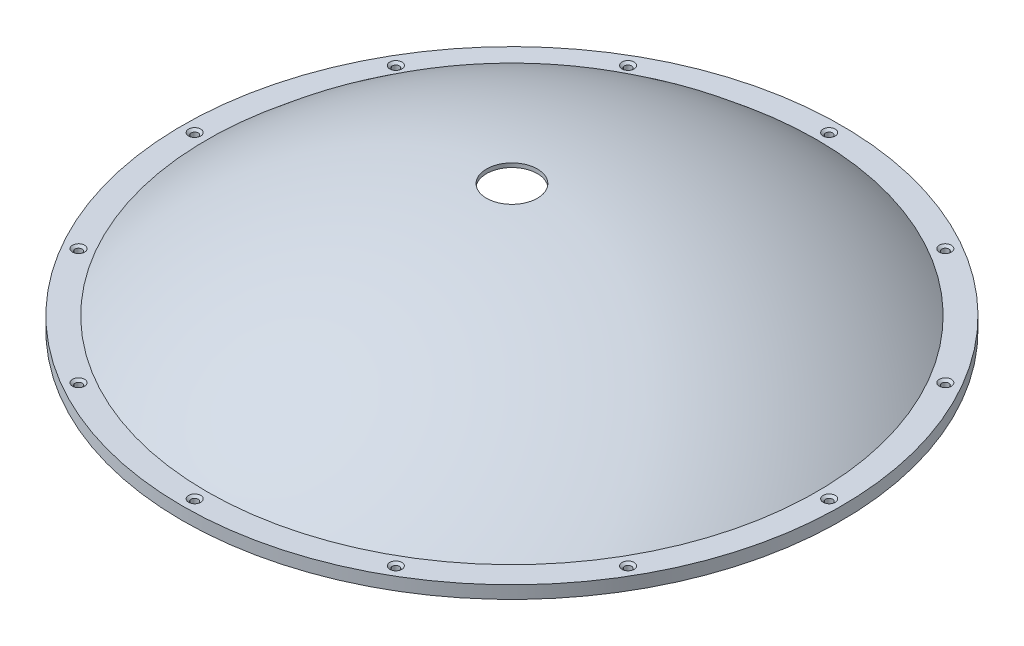
ISO-10303-21;
HEADER;
FILE_DESCRIPTION(('STEP AP214'),'2;1');
FILE_NAME('part.step','',(''),(''),'','','');
FILE_SCHEMA(('AUTOMOTIVE_DESIGN { 1 0 10303 214 1 1 1 1 }'));
ENDSEC;
DATA;
#1=APPLICATION_CONTEXT('core data for automotive mechanical design processes');
#2=APPLICATION_PROTOCOL_DEFINITION('international standard','automotive_design',2000,#1);
#3=PRODUCT_CONTEXT('',#1,'mechanical');
#4=PRODUCT('Part','Part','',(#3));
#5=PRODUCT_RELATED_PRODUCT_CATEGORY('part','',(#4));
#6=PRODUCT_DEFINITION_FORMATION('','',#4);
#7=PRODUCT_DEFINITION_CONTEXT('part definition',#1,'design');
#8=PRODUCT_DEFINITION('design','',#6,#7);
#9=PRODUCT_DEFINITION_SHAPE('','',#8);
#10=(LENGTH_UNIT() NAMED_UNIT(*) SI_UNIT(.MILLI.,.METRE.));
#11=(NAMED_UNIT(*) PLANE_ANGLE_UNIT() SI_UNIT($,.RADIAN.));
#12=(NAMED_UNIT(*) SI_UNIT($,.STERADIAN.) SOLID_ANGLE_UNIT());
#13=UNCERTAINTY_MEASURE_WITH_UNIT(LENGTH_MEASURE(1.E-05),#10,'distance_accuracy_value','');
#14=(GEOMETRIC_REPRESENTATION_CONTEXT(3) GLOBAL_UNCERTAINTY_ASSIGNED_CONTEXT((#13)) GLOBAL_UNIT_ASSIGNED_CONTEXT((#10,
#11,#12)) REPRESENTATION_CONTEXT('',''));
#15=CARTESIAN_POINT('',(0.,0.,0.));
#16=DIRECTION('',(0.,0.,1.));
#17=DIRECTION('',(1.,0.,0.));
#18=AXIS2_PLACEMENT_3D('',#15,#16,#17);
#19=CARTESIAN_POINT('',(0.,55.,0.));
#20=DIRECTION('',(0.,1.,0.));
#21=DIRECTION('',(0.,0.,1.));
#22=AXIS2_PLACEMENT_3D('',#19,#20,#21);
#23=CYLINDRICAL_SURFACE('',#22,82.3595);
#24=CARTESIAN_POINT('',(0.,0.,0.));
#25=DIRECTION('',(0.,1.,0.));
#26=DIRECTION('',(0.,0.,1.));
#27=AXIS2_PLACEMENT_3D('',#24,#25,#26);
#28=CIRCLE('',#27,82.3595);
#29=CARTESIAN_POINT('',(0.,0.,82.3595));
#30=VERTEX_POINT('',#29);
#31=EDGE_CURVE('E56',#30,#30,#28,.T.);
#32=ORIENTED_EDGE('',*,*,#31,.T.);
#33=EDGE_LOOP('',(#32));
#34=FACE_BOUND('',#33,.T.);
#35=CARTESIAN_POINT('',(0.,3.175,0.));
#36=DIRECTION('',(0.,1.,0.));
#37=DIRECTION('',(0.,0.,1.));
#38=AXIS2_PLACEMENT_3D('',#35,#36,#37);
#39=CIRCLE('',#38,82.3595);
#40=CARTESIAN_POINT('',(0.,3.175,82.3595));
#41=VERTEX_POINT('',#40);
#42=EDGE_CURVE('E10',#41,#41,#39,.T.);
#43=ORIENTED_EDGE('',*,*,#42,.F.);
#44=EDGE_LOOP('',(#43));
#45=FACE_BOUND('',#44,.T.);
#46=ADVANCED_FACE('F31',(#34,#45),#23,.T.);
#47=CARTESIAN_POINT('',(-82.3595,3.175,0.));
#48=DIRECTION('',(0.,1.,0.));
#49=DIRECTION('',(0.,0.,1.));
#50=AXIS2_PLACEMENT_3D('',#47,#48,#49);
#51=PLANE('',#50);
#52=CARTESIAN_POINT('',(-68.6582775056797,3.175,39.6398749999993));
#53=DIRECTION('',(0.,1.,0.));
#54=DIRECTION('',(0.,0.,1.));
#55=AXIS2_PLACEMENT_3D('',#52,#53,#54);
#56=CIRCLE('',#55,1.51129999999999);
#57=CARTESIAN_POINT('',(-68.6582775056797,3.175,41.1511749999993));
#58=VERTEX_POINT('',#57);
#59=EDGE_CURVE('E164',#58,#58,#56,.T.);
#60=ORIENTED_EDGE('',*,*,#59,.F.);
#61=EDGE_LOOP('',(#60));
#62=FACE_BOUND('',#61,.T.);
#63=CARTESIAN_POINT('',(-39.6398750000007,3.175,68.658277505679));
#64=DIRECTION('',(0.,1.,0.));
#65=DIRECTION('',(0.,0.,1.));
#66=AXIS2_PLACEMENT_3D('',#63,#64,#65);
#67=CIRCLE('',#66,1.5113);
#68=CARTESIAN_POINT('',(-39.6398750000007,3.175,70.169577505679));
#69=VERTEX_POINT('',#68);
#70=EDGE_CURVE('E155',#69,#69,#67,.T.);
#71=ORIENTED_EDGE('',*,*,#70,.F.);
#72=EDGE_LOOP('',(#71));
#73=FACE_BOUND('',#72,.T.);
#74=CARTESIAN_POINT('',(-6.89582176881005E-13,3.175,79.27975));
#75=DIRECTION('',(0.,1.,0.));
#76=DIRECTION('',(0.,0.,1.));
#77=AXIS2_PLACEMENT_3D('',#74,#75,#76);
#78=CIRCLE('',#77,1.5113);
#79=CARTESIAN_POINT('',(-6.89582176881005E-13,3.175,80.79105));
#80=VERTEX_POINT('',#79);
#81=EDGE_CURVE('E146',#80,#80,#78,.T.);
#82=ORIENTED_EDGE('',*,*,#81,.F.);
#83=EDGE_LOOP('',(#82));
#84=FACE_BOUND('',#83,.T.);
#85=CARTESIAN_POINT('',(39.6398749999995,3.175,68.6582775056796));
#86=DIRECTION('',(0.,1.,0.));
#87=DIRECTION('',(0.,0.,1.));
#88=AXIS2_PLACEMENT_3D('',#85,#86,#87);
#89=CIRCLE('',#88,1.5113);
#90=CARTESIAN_POINT('',(39.6398749999995,3.175,70.1695775056797));
#91=VERTEX_POINT('',#90);
#92=EDGE_CURVE('E137',#91,#91,#89,.T.);
#93=ORIENTED_EDGE('',*,*,#92,.F.);
#94=EDGE_LOOP('',(#93));
#95=FACE_BOUND('',#94,.T.);
#96=CARTESIAN_POINT('',(68.6582775056791,3.175,39.6398750000004));
#97=DIRECTION('',(0.,1.,0.));
#98=DIRECTION('',(0.,0.,1.));
#99=AXIS2_PLACEMENT_3D('',#96,#97,#98);
#100=CIRCLE('',#99,1.51130000000001);
#101=CARTESIAN_POINT('',(68.6582775056791,3.175,41.1511750000004));
#102=VERTEX_POINT('',#101);
#103=EDGE_CURVE('E128',#102,#102,#100,.T.);
#104=ORIENTED_EDGE('',*,*,#103,.F.);
#105=EDGE_LOOP('',(#104));
#106=FACE_BOUND('',#105,.T.);
#107=CARTESIAN_POINT('',(79.27975,3.175,4.47985690742466E-13));
#108=DIRECTION('',(0.,1.,0.));
#109=DIRECTION('',(0.,0.,1.));
#110=AXIS2_PLACEMENT_3D('',#107,#108,#109);
#111=CIRCLE('',#110,1.51129999999999);
#112=CARTESIAN_POINT('',(79.27975,3.175,1.51130000000044));
#113=VERTEX_POINT('',#112);
#114=EDGE_CURVE('E119',#113,#113,#111,.T.);
#115=ORIENTED_EDGE('',*,*,#114,.F.);
#116=EDGE_LOOP('',(#115));
#117=FACE_BOUND('',#116,.T.);
#118=CARTESIAN_POINT('',(68.6582775056795,3.175,-39.6398749999996));
#119=DIRECTION('',(0.,1.,0.));
#120=DIRECTION('',(0.,0.,1.));
#121=AXIS2_PLACEMENT_3D('',#118,#119,#120);
#122=CIRCLE('',#121,1.51130000000001);
#123=CARTESIAN_POINT('',(68.6582775056795,3.175,-38.1285749999996));
#124=VERTEX_POINT('',#123);
#125=EDGE_CURVE('E110',#124,#124,#122,.T.);
#126=ORIENTED_EDGE('',*,*,#125,.F.);
#127=EDGE_LOOP('',(#126));
#128=FACE_BOUND('',#127,.T.);
#129=CARTESIAN_POINT('',(39.6398750000002,3.175,-68.6582775056792));
#130=DIRECTION('',(0.,1.,0.));
#131=DIRECTION('',(0.,0.,1.));
#132=AXIS2_PLACEMENT_3D('',#129,#130,#131);
#133=CIRCLE('',#132,1.5113);
#134=CARTESIAN_POINT('',(39.6398750000002,3.175,-67.1469775056792));
#135=VERTEX_POINT('',#134);
#136=EDGE_CURVE('E101',#135,#135,#133,.T.);
#137=ORIENTED_EDGE('',*,*,#136,.F.);
#138=EDGE_LOOP('',(#137));
#139=FACE_BOUND('',#138,.T.);
#140=CARTESIAN_POINT('',(2.23992845371233E-13,3.175,-79.27975));
#141=DIRECTION('',(0.,1.,0.));
#142=DIRECTION('',(0.,0.,1.));
#143=AXIS2_PLACEMENT_3D('',#140,#141,#142);
#144=CIRCLE('',#143,1.5113);
#145=CARTESIAN_POINT('',(2.23992845371233E-13,3.175,-77.76845));
#146=VERTEX_POINT('',#145);
#147=EDGE_CURVE('E92',#146,#146,#144,.T.);
#148=ORIENTED_EDGE('',*,*,#147,.F.);
#149=EDGE_LOOP('',(#148));
#150=FACE_BOUND('',#149,.T.);
#151=CARTESIAN_POINT('',(-39.6398749999999,3.175,-68.6582775056794));
#152=DIRECTION('',(0.,1.,0.));
#153=DIRECTION('',(0.,0.,1.));
#154=AXIS2_PLACEMENT_3D('',#151,#152,#153);
#155=CIRCLE('',#154,1.5113);
#156=CARTESIAN_POINT('',(-39.6398749999999,3.175,-67.1469775056794));
#157=VERTEX_POINT('',#156);
#158=EDGE_CURVE('E83',#157,#157,#155,.T.);
#159=ORIENTED_EDGE('',*,*,#158,.F.);
#160=EDGE_LOOP('',(#159));
#161=FACE_BOUND('',#160,.T.);
#162=CARTESIAN_POINT('',(-68.6582775056793,3.175,-39.6398750000001));
#163=DIRECTION('',(0.,1.,0.));
#164=DIRECTION('',(0.,0.,1.));
#165=AXIS2_PLACEMENT_3D('',#162,#163,#164);
#166=CIRCLE('',#165,1.51130000000001);
#167=CARTESIAN_POINT('',(-68.6582775056793,3.175,-38.1285750000001));
#168=VERTEX_POINT('',#167);
#169=EDGE_CURVE('E74',#168,#168,#166,.T.);
#170=ORIENTED_EDGE('',*,*,#169,.F.);
#171=EDGE_LOOP('',(#170));
#172=FACE_BOUND('',#171,.T.);
#173=CARTESIAN_POINT('',(-79.27975,3.175,0.));
#174=DIRECTION('',(0.,1.,0.));
#175=DIRECTION('',(0.,0.,1.));
#176=AXIS2_PLACEMENT_3D('',#173,#174,#175);
#177=CIRCLE('',#176,1.51129999999999);
#178=CARTESIAN_POINT('',(-79.27975,3.175,1.51129999999999));
#179=VERTEX_POINT('',#178);
#180=EDGE_CURVE('E65',#179,#179,#177,.T.);
#181=ORIENTED_EDGE('',*,*,#180,.F.);
#182=EDGE_LOOP('',(#181));
#183=FACE_BOUND('',#182,.T.);
#184=ORIENTED_EDGE('',*,*,#42,.T.);
#185=EDGE_LOOP('',(#184));
#186=FACE_BOUND('',#185,.T.);
#187=CARTESIAN_POINT('',(0.,3.175,0.));
#188=DIRECTION('',(0.,1.,0.));
#189=DIRECTION('',(0.,0.,1.));
#190=AXIS2_PLACEMENT_3D('',#187,#188,#189);
#191=CIRCLE('',#190,76.2);
#192=CARTESIAN_POINT('',(0.,3.175,76.2));
#193=VERTEX_POINT('',#192);
#194=EDGE_CURVE('E37',#193,#193,#191,.T.);
#195=ORIENTED_EDGE('',*,*,#194,.F.);
#196=EDGE_LOOP('',(#195));
#197=FACE_BOUND('',#196,.T.);
#198=ADVANCED_FACE('F170',(#62,#73,#84,#95,#106,#117,#128,#139,#150,#161,#172,#183,#186,#197),
#51,.T.);
#199=CARTESIAN_POINT('',(0.,-83.3775265720187,0.));
#200=DIRECTION('',(0.,1.,0.));
#201=DIRECTION('',(-1.,0.,0.));
#202=AXIS2_PLACEMENT_3D('',#199,#200,#201);
#203=SPHERICAL_SURFACE('',#202,115.316);
#204=ORIENTED_EDGE('',*,*,#194,.T.);
#205=EDGE_LOOP('',(#204));
#206=FACE_BOUND('',#205,.T.);
#207=CARTESIAN_POINT('',(0.,31.7635058881777,0.));
#208=DIRECTION('',(0.,1.,0.));
#209=DIRECTION('',(0.,0.,1.));
#210=AXIS2_PLACEMENT_3D('',#207,#208,#209);
#211=CIRCLE('',#210,6.35);
#212=CARTESIAN_POINT('',(0.,31.7635058881777,6.35));
#213=VERTEX_POINT('',#212);
#214=EDGE_CURVE('E41',#213,#213,#211,.T.);
#215=ORIENTED_EDGE('',*,*,#214,.F.);
#216=EDGE_LOOP('',(#215));
#217=FACE_BOUND('',#216,.T.);
#218=ADVANCED_FACE('F173',(#206,#217),#203,.T.);
#219=CARTESIAN_POINT('',(0.,55.,0.));
#220=DIRECTION('',(0.,1.,0.));
#221=DIRECTION('',(0.,0.,1.));
#222=AXIS2_PLACEMENT_3D('',#219,#220,#221);
#223=CYLINDRICAL_SURFACE('',#222,6.35);
#224=ORIENTED_EDGE('',*,*,#214,.T.);
#225=EDGE_LOOP('',(#224));
#226=FACE_BOUND('',#225,.T.);
#227=CARTESIAN_POINT('',(0.,30.7459482261139,0.));
#228=DIRECTION('',(0.,1.,0.));
#229=DIRECTION('',(0.,0.,1.));
#230=AXIS2_PLACEMENT_3D('',#227,#228,#229);
#231=CIRCLE('',#230,6.35);
#232=CARTESIAN_POINT('',(0.,30.7459482261139,6.35));
#233=VERTEX_POINT('',#232);
#234=EDGE_CURVE('E45',#233,#233,#231,.T.);
#235=ORIENTED_EDGE('',*,*,#234,.F.);
#236=EDGE_LOOP('',(#235));
#237=FACE_BOUND('',#236,.T.);
#238=ADVANCED_FACE('F235',(#226,#237),#223,.F.);
#239=CARTESIAN_POINT('',(0.,-83.3775265720187,0.));
#240=DIRECTION('',(0.,1.,0.));
#241=DIRECTION('',(-1.,0.,0.));
#242=AXIS2_PLACEMENT_3D('',#239,#240,#241);
#243=SPHERICAL_SURFACE('',#242,114.3);
#244=ORIENTED_EDGE('',*,*,#234,.T.);
#245=EDGE_LOOP('',(#244));
#246=FACE_BOUND('',#245,.T.);
#247=CARTESIAN_POINT('',(0.,3.03844938448129,0.));
#248=DIRECTION('',(0.,1.,0.));
#249=DIRECTION('',(0.,0.,1.));
#250=AXIS2_PLACEMENT_3D('',#247,#248,#249);
#251=CIRCLE('',#250,74.8115572587927);
#252=CARTESIAN_POINT('',(0.,3.03844938448129,74.8115572587927));
#253=VERTEX_POINT('',#252);
#254=EDGE_CURVE('E50',#253,#253,#251,.T.);
#255=ORIENTED_EDGE('',*,*,#254,.F.);
#256=EDGE_LOOP('',(#255));
#257=FACE_BOUND('',#256,.T.);
#258=ADVANCED_FACE('F228',(#246,#257),#243,.F.);
#259=CARTESIAN_POINT('',(0.,0.,0.));
#260=DIRECTION('',(0.,1.,0.));
#261=DIRECTION('',(0.,0.,1.));
#262=AXIS2_PLACEMENT_3D('',#259,#260,#261);
#263=TOROIDAL_SURFACE('',#262,72.1811277856651,4.01887221433488);
#264=ORIENTED_EDGE('',*,*,#254,.T.);
#265=EDGE_LOOP('',(#264));
#266=FACE_BOUND('',#265,.T.);
#267=CARTESIAN_POINT('',(0.,0.,0.));
#268=DIRECTION('',(0.,1.,0.));
#269=DIRECTION('',(0.,0.,1.));
#270=AXIS2_PLACEMENT_3D('',#267,#268,#269);
#271=CIRCLE('',#270,76.2);
#272=CARTESIAN_POINT('',(0.,0.,76.2));
#273=VERTEX_POINT('',#272);
#274=EDGE_CURVE('E53',#273,#273,#271,.T.);
#275=ORIENTED_EDGE('',*,*,#274,.F.);
#276=EDGE_LOOP('',(#275));
#277=FACE_BOUND('',#276,.T.);
#278=ADVANCED_FACE('F222',(#266,#277),#263,.F.);
#279=CARTESIAN_POINT('',(-82.3595,0.,0.));
#280=DIRECTION('',(0.,-1.,0.));
#281=DIRECTION('',(0.,0.,-1.));
#282=AXIS2_PLACEMENT_3D('',#279,#280,#281);
#283=PLANE('',#282);
#284=CARTESIAN_POINT('',(-68.6582775056797,0.,39.6398749999993));
#285=DIRECTION('',(0.,1.,0.));
#286=DIRECTION('',(0.,0.,1.));
#287=AXIS2_PLACEMENT_3D('',#284,#285,#286);
#288=CIRCLE('',#287,0.889000000000001);
#289=CARTESIAN_POINT('',(-68.6582775056797,0.,40.5288749999993));
#290=VERTEX_POINT('',#289);
#291=EDGE_CURVE('E158',#290,#290,#288,.T.);
#292=ORIENTED_EDGE('',*,*,#291,.T.);
#293=EDGE_LOOP('',(#292));
#294=FACE_BOUND('',#293,.T.);
#295=CARTESIAN_POINT('',(-39.6398750000007,0.,68.658277505679));
#296=DIRECTION('',(0.,1.,0.));
#297=DIRECTION('',(0.,0.,1.));
#298=AXIS2_PLACEMENT_3D('',#295,#296,#297);
#299=CIRCLE('',#298,0.889000000000001);
#300=CARTESIAN_POINT('',(-39.6398750000007,0.,69.5472775056789));
#301=VERTEX_POINT('',#300);
#302=EDGE_CURVE('E149',#301,#301,#299,.T.);
#303=ORIENTED_EDGE('',*,*,#302,.T.);
#304=EDGE_LOOP('',(#303));
#305=FACE_BOUND('',#304,.T.);
#306=CARTESIAN_POINT('',(-6.89582176881005E-13,0.,79.27975));
#307=DIRECTION('',(0.,1.,0.));
#308=DIRECTION('',(0.,0.,1.));
#309=AXIS2_PLACEMENT_3D('',#306,#307,#308);
#310=CIRCLE('',#309,0.888999999999999);
#311=CARTESIAN_POINT('',(-6.89582176881005E-13,0.,80.16875));
#312=VERTEX_POINT('',#311);
#313=EDGE_CURVE('E140',#312,#312,#310,.T.);
#314=ORIENTED_EDGE('',*,*,#313,.T.);
#315=EDGE_LOOP('',(#314));
#316=FACE_BOUND('',#315,.T.);
#317=CARTESIAN_POINT('',(39.6398749999995,0.,68.6582775056796));
#318=DIRECTION('',(0.,1.,0.));
#319=DIRECTION('',(0.,0.,1.));
#320=AXIS2_PLACEMENT_3D('',#317,#318,#319);
#321=CIRCLE('',#320,0.889000000000001);
#322=CARTESIAN_POINT('',(39.6398749999995,0.,69.5472775056796));
#323=VERTEX_POINT('',#322);
#324=EDGE_CURVE('E131',#323,#323,#321,.T.);
#325=ORIENTED_EDGE('',*,*,#324,.T.);
#326=EDGE_LOOP('',(#325));
#327=FACE_BOUND('',#326,.T.);
#328=CARTESIAN_POINT('',(68.6582775056791,0.,39.6398750000004));
#329=DIRECTION('',(0.,1.,0.));
#330=DIRECTION('',(0.,0.,1.));
#331=AXIS2_PLACEMENT_3D('',#328,#329,#330);
#332=CIRCLE('',#331,0.889000000000001);
#333=CARTESIAN_POINT('',(68.6582775056791,0.,40.5288750000004));
#334=VERTEX_POINT('',#333);
#335=EDGE_CURVE('E122',#334,#334,#332,.T.);
#336=ORIENTED_EDGE('',*,*,#335,.T.);
#337=EDGE_LOOP('',(#336));
#338=FACE_BOUND('',#337,.T.);
#339=CARTESIAN_POINT('',(79.27975,0.,4.47985690742466E-13));
#340=DIRECTION('',(0.,1.,0.));
#341=DIRECTION('',(0.,0.,1.));
#342=AXIS2_PLACEMENT_3D('',#339,#340,#341);
#343=CIRCLE('',#342,0.889000000000001);
#344=CARTESIAN_POINT('',(79.27975,0.,0.889000000000449));
#345=VERTEX_POINT('',#344);
#346=EDGE_CURVE('E113',#345,#345,#343,.T.);
#347=ORIENTED_EDGE('',*,*,#346,.T.);
#348=EDGE_LOOP('',(#347));
#349=FACE_BOUND('',#348,.T.);
#350=CARTESIAN_POINT('',(68.6582775056795,0.,-39.6398749999996));
#351=DIRECTION('',(0.,1.,0.));
#352=DIRECTION('',(0.,0.,1.));
#353=AXIS2_PLACEMENT_3D('',#350,#351,#352);
#354=CIRCLE('',#353,0.889000000000001);
#355=CARTESIAN_POINT('',(68.6582775056795,0.,-38.7508749999997));
#356=VERTEX_POINT('',#355);
#357=EDGE_CURVE('E104',#356,#356,#354,.T.);
#358=ORIENTED_EDGE('',*,*,#357,.T.);
#359=EDGE_LOOP('',(#358));
#360=FACE_BOUND('',#359,.T.);
#361=CARTESIAN_POINT('',(39.6398750000002,0.,-68.6582775056792));
#362=DIRECTION('',(0.,1.,0.));
#363=DIRECTION('',(0.,0.,1.));
#364=AXIS2_PLACEMENT_3D('',#361,#362,#363);
#365=CIRCLE('',#364,0.889000000000001);
#366=CARTESIAN_POINT('',(39.6398750000002,0.,-67.7692775056792));
#367=VERTEX_POINT('',#366);
#368=EDGE_CURVE('E95',#367,#367,#365,.T.);
#369=ORIENTED_EDGE('',*,*,#368,.T.);
#370=EDGE_LOOP('',(#369));
#371=FACE_BOUND('',#370,.T.);
#372=CARTESIAN_POINT('',(2.23992845371233E-13,0.,-79.27975));
#373=DIRECTION('',(0.,1.,0.));
#374=DIRECTION('',(0.,0.,1.));
#375=AXIS2_PLACEMENT_3D('',#372,#373,#374);
#376=CIRCLE('',#375,0.888999999999999);
#377=CARTESIAN_POINT('',(2.23992845371233E-13,0.,-78.39075));
#378=VERTEX_POINT('',#377);
#379=EDGE_CURVE('E86',#378,#378,#376,.T.);
#380=ORIENTED_EDGE('',*,*,#379,.T.);
#381=EDGE_LOOP('',(#380));
#382=FACE_BOUND('',#381,.T.);
#383=CARTESIAN_POINT('',(-39.6398749999999,0.,-68.6582775056794));
#384=DIRECTION('',(0.,1.,0.));
#385=DIRECTION('',(0.,0.,1.));
#386=AXIS2_PLACEMENT_3D('',#383,#384,#385);
#387=CIRCLE('',#386,0.889000000000001);
#388=CARTESIAN_POINT('',(-39.6398749999999,0.,-67.7692775056794));
#389=VERTEX_POINT('',#388);
#390=EDGE_CURVE('E77',#389,#389,#387,.T.);
#391=ORIENTED_EDGE('',*,*,#390,.T.);
#392=EDGE_LOOP('',(#391));
#393=FACE_BOUND('',#392,.T.);
#394=CARTESIAN_POINT('',(-68.6582775056793,0.,-39.6398750000001));
#395=DIRECTION('',(0.,1.,0.));
#396=DIRECTION('',(0.,0.,1.));
#397=AXIS2_PLACEMENT_3D('',#394,#395,#396);
#398=CIRCLE('',#397,0.889000000000001);
#399=CARTESIAN_POINT('',(-68.6582775056793,0.,-38.7508750000001));
#400=VERTEX_POINT('',#399);
#401=EDGE_CURVE('E68',#400,#400,#398,.T.);
#402=ORIENTED_EDGE('',*,*,#401,.T.);
#403=EDGE_LOOP('',(#402));
#404=FACE_BOUND('',#403,.T.);
#405=CARTESIAN_POINT('',(-79.27975,0.,0.));
#406=DIRECTION('',(0.,1.,0.));
#407=DIRECTION('',(0.,0.,1.));
#408=AXIS2_PLACEMENT_3D('',#405,#406,#407);
#409=CIRCLE('',#408,0.889000000000001);
#410=CARTESIAN_POINT('',(-79.27975,0.,0.889000000000001));
#411=VERTEX_POINT('',#410);
#412=EDGE_CURVE('E59',#411,#411,#409,.T.);
#413=ORIENTED_EDGE('',*,*,#412,.T.);
#414=EDGE_LOOP('',(#413));
#415=FACE_BOUND('',#414,.T.);
#416=ORIENTED_EDGE('',*,*,#274,.T.);
#417=EDGE_LOOP('',(#416));
#418=FACE_BOUND('',#417,.T.);
#419=ORIENTED_EDGE('',*,*,#31,.F.);
#420=EDGE_LOOP('',(#419));
#421=FACE_BOUND('',#420,.T.);
#422=ADVANCED_FACE('F210',(#294,#305,#316,#327,#338,#349,#360,#371,#382,#393,#404,#415,#418,
#421),#283,.T.);
#423=CARTESIAN_POINT('',(-79.27975,3.175,0.));
#424=DIRECTION('',(0.,1.,0.));
#425=DIRECTION('',(0.,0.,1.));
#426=AXIS2_PLACEMENT_3D('',#423,#424,#425);
#427=CYLINDRICAL_SURFACE('',#426,0.889000000000001);
#428=ORIENTED_EDGE('',*,*,#412,.F.);
#429=EDGE_LOOP('',(#428));
#430=FACE_BOUND('',#429,.T.);
#431=CARTESIAN_POINT('',(-79.27975,2.65282829951838,0.));
#432=DIRECTION('',(0.,1.,0.));
#433=DIRECTION('',(0.,0.,1.));
#434=AXIS2_PLACEMENT_3D('',#431,#432,#433);
#435=CIRCLE('',#434,0.889000000000001);
#436=CARTESIAN_POINT('',(-79.27975,2.65282829951838,0.889000000000001));
#437=VERTEX_POINT('',#436);
#438=EDGE_CURVE('E62',#437,#437,#435,.T.);
#439=ORIENTED_EDGE('',*,*,#438,.T.);
#440=EDGE_LOOP('',(#439));
#441=FACE_BOUND('',#440,.T.);
#442=ADVANCED_FACE('F200',(#430,#441),#427,.F.);
#443=CARTESIAN_POINT('',(-79.27975,3.175,0.));
#444=DIRECTION('',(0.,1.,0.));
#445=DIRECTION('',(0.,0.,1.));
#446=AXIS2_PLACEMENT_3D('',#443,#444,#445);
#447=CONICAL_SURFACE('',#446,1.51129999999999,0.872664625997156);
#448=ORIENTED_EDGE('',*,*,#438,.F.);
#449=EDGE_LOOP('',(#448));
#450=FACE_BOUND('',#449,.T.);
#451=ORIENTED_EDGE('',*,*,#180,.T.);
#452=EDGE_LOOP('',(#451));
#453=FACE_BOUND('',#452,.T.);
#454=ADVANCED_FACE('F197',(#450,#453),#447,.F.);
#455=CARTESIAN_POINT('',(-68.6582775056793,3.175,-39.6398750000001));
#456=DIRECTION('',(0.,1.,0.));
#457=DIRECTION('',(0.,0.,1.));
#458=AXIS2_PLACEMENT_3D('',#455,#456,#457);
#459=CYLINDRICAL_SURFACE('',#458,0.889000000000001);
#460=ORIENTED_EDGE('',*,*,#401,.F.);
#461=EDGE_LOOP('',(#460));
#462=FACE_BOUND('',#461,.T.);
#463=CARTESIAN_POINT('',(-68.6582775056793,2.65282829951838,-39.6398750000001));
#464=DIRECTION('',(0.,1.,0.));
#465=DIRECTION('',(0.,0.,1.));
#466=AXIS2_PLACEMENT_3D('',#463,#464,#465);
#467=CIRCLE('',#466,0.889000000000001);
#468=CARTESIAN_POINT('',(-68.6582775056793,2.65282829951838,-38.7508750000001));
#469=VERTEX_POINT('',#468);
#470=EDGE_CURVE('E71',#469,#469,#467,.T.);
#471=ORIENTED_EDGE('',*,*,#470,.T.);
#472=EDGE_LOOP('',(#471));
#473=FACE_BOUND('',#472,.T.);
#474=ADVANCED_FACE('F199',(#462,#473),#459,.F.);
#475=CARTESIAN_POINT('',(-68.6582775056793,3.175,-39.6398750000001));
#476=DIRECTION('',(0.,1.,0.));
#477=DIRECTION('',(0.,0.,1.));
#478=AXIS2_PLACEMENT_3D('',#475,#476,#477);
#479=CONICAL_SURFACE('',#478,1.51130000000001,0.872664625997167);
#480=ORIENTED_EDGE('',*,*,#470,.F.);
#481=EDGE_LOOP('',(#480));
#482=FACE_BOUND('',#481,.T.);
#483=ORIENTED_EDGE('',*,*,#169,.T.);
#484=EDGE_LOOP('',(#483));
#485=FACE_BOUND('',#484,.T.);
#486=ADVANCED_FACE('F207',(#482,#485),#479,.F.);
#487=CARTESIAN_POINT('',(-39.6398749999999,3.175,-68.6582775056794));
#488=DIRECTION('',(0.,1.,0.));
#489=DIRECTION('',(0.,0.,1.));
#490=AXIS2_PLACEMENT_3D('',#487,#488,#489);
#491=CYLINDRICAL_SURFACE('',#490,0.889000000000001);
#492=ORIENTED_EDGE('',*,*,#390,.F.);
#493=EDGE_LOOP('',(#492));
#494=FACE_BOUND('',#493,.T.);
#495=CARTESIAN_POINT('',(-39.6398749999999,2.65282829951838,-68.6582775056794));
#496=DIRECTION('',(0.,1.,0.));
#497=DIRECTION('',(0.,0.,1.));
#498=AXIS2_PLACEMENT_3D('',#495,#496,#497);
#499=CIRCLE('',#498,0.889000000000001);
#500=CARTESIAN_POINT('',(-39.6398749999999,2.65282829951838,-67.7692775056794));
#501=VERTEX_POINT('',#500);
#502=EDGE_CURVE('E80',#501,#501,#499,.T.);
#503=ORIENTED_EDGE('',*,*,#502,.T.);
#504=EDGE_LOOP('',(#503));
#505=FACE_BOUND('',#504,.T.);
#506=ADVANCED_FACE('F300',(#494,#505),#491,.F.);
#507=CARTESIAN_POINT('',(-39.6398749999999,3.175,-68.6582775056794));
#508=DIRECTION('',(0.,1.,0.));
#509=DIRECTION('',(0.,0.,1.));
#510=AXIS2_PLACEMENT_3D('',#507,#508,#509);
#511=CONICAL_SURFACE('',#510,1.5113,0.872664625997162);
#512=ORIENTED_EDGE('',*,*,#502,.F.);
#513=EDGE_LOOP('',(#512));
#514=FACE_BOUND('',#513,.T.);
#515=ORIENTED_EDGE('',*,*,#158,.T.);
#516=EDGE_LOOP('',(#515));
#517=FACE_BOUND('',#516,.T.);
#518=ADVANCED_FACE('F310',(#514,#517),#511,.F.);
#519=CARTESIAN_POINT('',(2.23992845371233E-13,3.175,-79.27975));
#520=DIRECTION('',(0.,1.,0.));
#521=DIRECTION('',(0.,0.,1.));
#522=AXIS2_PLACEMENT_3D('',#519,#520,#521);
#523=CYLINDRICAL_SURFACE('',#522,0.888999999999999);
#524=ORIENTED_EDGE('',*,*,#379,.F.);
#525=EDGE_LOOP('',(#524));
#526=FACE_BOUND('',#525,.T.);
#527=CARTESIAN_POINT('',(2.23992845371233E-13,2.65282829951838,-79.27975));
#528=DIRECTION('',(0.,1.,0.));
#529=DIRECTION('',(0.,0.,1.));
#530=AXIS2_PLACEMENT_3D('',#527,#528,#529);
#531=CIRCLE('',#530,0.888999999999999);
#532=CARTESIAN_POINT('',(2.23992845371233E-13,2.65282829951838,-78.39075));
#533=VERTEX_POINT('',#532);
#534=EDGE_CURVE('E89',#533,#533,#531,.T.);
#535=ORIENTED_EDGE('',*,*,#534,.T.);
#536=EDGE_LOOP('',(#535));
#537=FACE_BOUND('',#536,.T.);
#538=ADVANCED_FACE('F320',(#526,#537),#523,.F.);
#539=CARTESIAN_POINT('',(2.23992845371233E-13,3.175,-79.27975));
#540=DIRECTION('',(0.,1.,0.));
#541=DIRECTION('',(0.,0.,1.));
#542=AXIS2_PLACEMENT_3D('',#539,#540,#541);
#543=CONICAL_SURFACE('',#542,1.5113,0.872664625997163);
#544=ORIENTED_EDGE('',*,*,#534,.F.);
#545=EDGE_LOOP('',(#544));
#546=FACE_BOUND('',#545,.T.);
#547=ORIENTED_EDGE('',*,*,#147,.T.);
#548=EDGE_LOOP('',(#547));
#549=FACE_BOUND('',#548,.T.);
#550=ADVANCED_FACE('F330',(#546,#549),#543,.F.);
#551=CARTESIAN_POINT('',(39.6398750000002,3.175,-68.6582775056792));
#552=DIRECTION('',(0.,1.,0.));
#553=DIRECTION('',(0.,0.,1.));
#554=AXIS2_PLACEMENT_3D('',#551,#552,#553);
#555=CYLINDRICAL_SURFACE('',#554,0.889000000000001);
#556=ORIENTED_EDGE('',*,*,#368,.F.);
#557=EDGE_LOOP('',(#556));
#558=FACE_BOUND('',#557,.T.);
#559=CARTESIAN_POINT('',(39.6398750000002,2.65282829951838,-68.6582775056792));
#560=DIRECTION('',(0.,1.,0.));
#561=DIRECTION('',(0.,0.,1.));
#562=AXIS2_PLACEMENT_3D('',#559,#560,#561);
#563=CIRCLE('',#562,0.889000000000001);
#564=CARTESIAN_POINT('',(39.6398750000002,2.65282829951838,-67.7692775056792));
#565=VERTEX_POINT('',#564);
#566=EDGE_CURVE('E98',#565,#565,#563,.T.);
#567=ORIENTED_EDGE('',*,*,#566,.T.);
#568=EDGE_LOOP('',(#567));
#569=FACE_BOUND('',#568,.T.);
#570=ADVANCED_FACE('F340',(#558,#569),#555,.F.);
#571=CARTESIAN_POINT('',(39.6398750000002,3.175,-68.6582775056792));
#572=DIRECTION('',(0.,1.,0.));
#573=DIRECTION('',(0.,0.,1.));
#574=AXIS2_PLACEMENT_3D('',#571,#572,#573);
#575=CONICAL_SURFACE('',#574,1.5113,0.872664625997162);
#576=ORIENTED_EDGE('',*,*,#566,.F.);
#577=EDGE_LOOP('',(#576));
#578=FACE_BOUND('',#577,.T.);
#579=ORIENTED_EDGE('',*,*,#136,.T.);
#580=EDGE_LOOP('',(#579));
#581=FACE_BOUND('',#580,.T.);
#582=ADVANCED_FACE('F350',(#578,#581),#575,.F.);
#583=CARTESIAN_POINT('',(68.6582775056795,3.175,-39.6398749999996));
#584=DIRECTION('',(0.,1.,0.));
#585=DIRECTION('',(0.,0.,1.));
#586=AXIS2_PLACEMENT_3D('',#583,#584,#585);
#587=CYLINDRICAL_SURFACE('',#586,0.889000000000001);
#588=ORIENTED_EDGE('',*,*,#357,.F.);
#589=EDGE_LOOP('',(#588));
#590=FACE_BOUND('',#589,.T.);
#591=CARTESIAN_POINT('',(68.6582775056795,2.65282829951838,-39.6398749999996));
#592=DIRECTION('',(0.,1.,0.));
#593=DIRECTION('',(0.,0.,1.));
#594=AXIS2_PLACEMENT_3D('',#591,#592,#593);
#595=CIRCLE('',#594,0.889000000000001);
#596=CARTESIAN_POINT('',(68.6582775056795,2.65282829951838,-38.7508749999997));
#597=VERTEX_POINT('',#596);
#598=EDGE_CURVE('E107',#597,#597,#595,.T.);
#599=ORIENTED_EDGE('',*,*,#598,.T.);
#600=EDGE_LOOP('',(#599));
#601=FACE_BOUND('',#600,.T.);
#602=ADVANCED_FACE('F360',(#590,#601),#587,.F.);
#603=CARTESIAN_POINT('',(68.6582775056795,3.175,-39.6398749999996));
#604=DIRECTION('',(0.,1.,0.));
#605=DIRECTION('',(0.,0.,1.));
#606=AXIS2_PLACEMENT_3D('',#603,#604,#605);
#607=CONICAL_SURFACE('',#606,1.51130000000001,0.872664625997167);
#608=ORIENTED_EDGE('',*,*,#598,.F.);
#609=EDGE_LOOP('',(#608));
#610=FACE_BOUND('',#609,.T.);
#611=ORIENTED_EDGE('',*,*,#125,.T.);
#612=EDGE_LOOP('',(#611));
#613=FACE_BOUND('',#612,.T.);
#614=ADVANCED_FACE('F370',(#610,#613),#607,.F.);
#615=CARTESIAN_POINT('',(79.27975,3.175,4.47985690742466E-13));
#616=DIRECTION('',(0.,1.,0.));
#617=DIRECTION('',(0.,0.,1.));
#618=AXIS2_PLACEMENT_3D('',#615,#616,#617);
#619=CYLINDRICAL_SURFACE('',#618,0.889000000000001);
#620=ORIENTED_EDGE('',*,*,#346,.F.);
#621=EDGE_LOOP('',(#620));
#622=FACE_BOUND('',#621,.T.);
#623=CARTESIAN_POINT('',(79.27975,2.65282829951838,4.47985690742466E-13));
#624=DIRECTION('',(0.,1.,0.));
#625=DIRECTION('',(0.,0.,1.));
#626=AXIS2_PLACEMENT_3D('',#623,#624,#625);
#627=CIRCLE('',#626,0.889000000000001);
#628=CARTESIAN_POINT('',(79.27975,2.65282829951838,0.889000000000449));
#629=VERTEX_POINT('',#628);
#630=EDGE_CURVE('E116',#629,#629,#627,.T.);
#631=ORIENTED_EDGE('',*,*,#630,.T.);
#632=EDGE_LOOP('',(#631));
#633=FACE_BOUND('',#632,.T.);
#634=ADVANCED_FACE('F380',(#622,#633),#619,.F.);
#635=CARTESIAN_POINT('',(79.27975,3.175,4.47985690742466E-13));
#636=DIRECTION('',(0.,1.,0.));
#637=DIRECTION('',(0.,0.,1.));
#638=AXIS2_PLACEMENT_3D('',#635,#636,#637);
#639=CONICAL_SURFACE('',#638,1.51129999999999,0.872664625997156);
#640=ORIENTED_EDGE('',*,*,#630,.F.);
#641=EDGE_LOOP('',(#640));
#642=FACE_BOUND('',#641,.T.);
#643=ORIENTED_EDGE('',*,*,#114,.T.);
#644=EDGE_LOOP('',(#643));
#645=FACE_BOUND('',#644,.T.);
#646=ADVANCED_FACE('F390',(#642,#645),#639,.F.);
#647=CARTESIAN_POINT('',(68.6582775056791,3.175,39.6398750000004));
#648=DIRECTION('',(0.,1.,0.));
#649=DIRECTION('',(0.,0.,1.));
#650=AXIS2_PLACEMENT_3D('',#647,#648,#649);
#651=CYLINDRICAL_SURFACE('',#650,0.889000000000001);
#652=ORIENTED_EDGE('',*,*,#335,.F.);
#653=EDGE_LOOP('',(#652));
#654=FACE_BOUND('',#653,.T.);
#655=CARTESIAN_POINT('',(68.6582775056791,2.65282829951838,39.6398750000004));
#656=DIRECTION('',(0.,1.,0.));
#657=DIRECTION('',(0.,0.,1.));
#658=AXIS2_PLACEMENT_3D('',#655,#656,#657);
#659=CIRCLE('',#658,0.889000000000001);
#660=CARTESIAN_POINT('',(68.6582775056791,2.65282829951838,40.5288750000004));
#661=VERTEX_POINT('',#660);
#662=EDGE_CURVE('E125',#661,#661,#659,.T.);
#663=ORIENTED_EDGE('',*,*,#662,.T.);
#664=EDGE_LOOP('',(#663));
#665=FACE_BOUND('',#664,.T.);
#666=ADVANCED_FACE('F400',(#654,#665),#651,.F.);
#667=CARTESIAN_POINT('',(68.6582775056791,3.175,39.6398750000004));
#668=DIRECTION('',(0.,1.,0.));
#669=DIRECTION('',(0.,0.,1.));
#670=AXIS2_PLACEMENT_3D('',#667,#668,#669);
#671=CONICAL_SURFACE('',#670,1.51130000000001,0.872664625997167);
#672=ORIENTED_EDGE('',*,*,#662,.F.);
#673=EDGE_LOOP('',(#672));
#674=FACE_BOUND('',#673,.T.);
#675=ORIENTED_EDGE('',*,*,#103,.T.);
#676=EDGE_LOOP('',(#675));
#677=FACE_BOUND('',#676,.T.);
#678=ADVANCED_FACE('F410',(#674,#677),#671,.F.);
#679=CARTESIAN_POINT('',(39.6398749999995,3.175,68.6582775056796));
#680=DIRECTION('',(0.,1.,0.));
#681=DIRECTION('',(0.,0.,1.));
#682=AXIS2_PLACEMENT_3D('',#679,#680,#681);
#683=CYLINDRICAL_SURFACE('',#682,0.889000000000001);
#684=ORIENTED_EDGE('',*,*,#324,.F.);
#685=EDGE_LOOP('',(#684));
#686=FACE_BOUND('',#685,.T.);
#687=CARTESIAN_POINT('',(39.6398749999995,2.65282829951838,68.6582775056796));
#688=DIRECTION('',(0.,1.,0.));
#689=DIRECTION('',(0.,0.,1.));
#690=AXIS2_PLACEMENT_3D('',#687,#688,#689);
#691=CIRCLE('',#690,0.889000000000001);
#692=CARTESIAN_POINT('',(39.6398749999995,2.65282829951838,69.5472775056796));
#693=VERTEX_POINT('',#692);
#694=EDGE_CURVE('E134',#693,#693,#691,.T.);
#695=ORIENTED_EDGE('',*,*,#694,.T.);
#696=EDGE_LOOP('',(#695));
#697=FACE_BOUND('',#696,.T.);
#698=ADVANCED_FACE('F420',(#686,#697),#683,.F.);
#699=CARTESIAN_POINT('',(39.6398749999995,3.175,68.6582775056796));
#700=DIRECTION('',(0.,1.,0.));
#701=DIRECTION('',(0.,0.,1.));
#702=AXIS2_PLACEMENT_3D('',#699,#700,#701);
#703=CONICAL_SURFACE('',#702,1.5113,0.872664625997162);
#704=ORIENTED_EDGE('',*,*,#694,.F.);
#705=EDGE_LOOP('',(#704));
#706=FACE_BOUND('',#705,.T.);
#707=ORIENTED_EDGE('',*,*,#92,.T.);
#708=EDGE_LOOP('',(#707));
#709=FACE_BOUND('',#708,.T.);
#710=ADVANCED_FACE('F430',(#706,#709),#703,.F.);
#711=CARTESIAN_POINT('',(-6.89582176881005E-13,3.175,79.27975));
#712=DIRECTION('',(0.,1.,0.));
#713=DIRECTION('',(0.,0.,1.));
#714=AXIS2_PLACEMENT_3D('',#711,#712,#713);
#715=CYLINDRICAL_SURFACE('',#714,0.888999999999999);
#716=ORIENTED_EDGE('',*,*,#313,.F.);
#717=EDGE_LOOP('',(#716));
#718=FACE_BOUND('',#717,.T.);
#719=CARTESIAN_POINT('',(-6.89582176881005E-13,2.65282829951838,79.27975));
#720=DIRECTION('',(0.,1.,0.));
#721=DIRECTION('',(0.,0.,1.));
#722=AXIS2_PLACEMENT_3D('',#719,#720,#721);
#723=CIRCLE('',#722,0.888999999999999);
#724=CARTESIAN_POINT('',(-6.89582176881005E-13,2.65282829951838,80.16875));
#725=VERTEX_POINT('',#724);
#726=EDGE_CURVE('E143',#725,#725,#723,.T.);
#727=ORIENTED_EDGE('',*,*,#726,.T.);
#728=EDGE_LOOP('',(#727));
#729=FACE_BOUND('',#728,.T.);
#730=ADVANCED_FACE('F440',(#718,#729),#715,.F.);
#731=CARTESIAN_POINT('',(-6.89582176881005E-13,3.175,79.27975));
#732=DIRECTION('',(0.,1.,0.));
#733=DIRECTION('',(0.,0.,1.));
#734=AXIS2_PLACEMENT_3D('',#731,#732,#733);
#735=CONICAL_SURFACE('',#734,1.5113,0.872664625997163);
#736=ORIENTED_EDGE('',*,*,#726,.F.);
#737=EDGE_LOOP('',(#736));
#738=FACE_BOUND('',#737,.T.);
#739=ORIENTED_EDGE('',*,*,#81,.T.);
#740=EDGE_LOOP('',(#739));
#741=FACE_BOUND('',#740,.T.);
#742=ADVANCED_FACE('F450',(#738,#741),#735,.F.);
#743=CARTESIAN_POINT('',(-39.6398750000007,3.175,68.658277505679));
#744=DIRECTION('',(0.,1.,0.));
#745=DIRECTION('',(0.,0.,1.));
#746=AXIS2_PLACEMENT_3D('',#743,#744,#745);
#747=CYLINDRICAL_SURFACE('',#746,0.889000000000001);
#748=ORIENTED_EDGE('',*,*,#302,.F.);
#749=EDGE_LOOP('',(#748));
#750=FACE_BOUND('',#749,.T.);
#751=CARTESIAN_POINT('',(-39.6398750000007,2.65282829951838,68.658277505679));
#752=DIRECTION('',(0.,1.,0.));
#753=DIRECTION('',(0.,0.,1.));
#754=AXIS2_PLACEMENT_3D('',#751,#752,#753);
#755=CIRCLE('',#754,0.889000000000001);
#756=CARTESIAN_POINT('',(-39.6398750000007,2.65282829951838,69.5472775056789));
#757=VERTEX_POINT('',#756);
#758=EDGE_CURVE('E152',#757,#757,#755,.T.);
#759=ORIENTED_EDGE('',*,*,#758,.T.);
#760=EDGE_LOOP('',(#759));
#761=FACE_BOUND('',#760,.T.);
#762=ADVANCED_FACE('F460',(#750,#761),#747,.F.);
#763=CARTESIAN_POINT('',(-39.6398750000007,3.175,68.658277505679));
#764=DIRECTION('',(0.,1.,0.));
#765=DIRECTION('',(0.,0.,1.));
#766=AXIS2_PLACEMENT_3D('',#763,#764,#765);
#767=CONICAL_SURFACE('',#766,1.5113,0.872664625997162);
#768=ORIENTED_EDGE('',*,*,#758,.F.);
#769=EDGE_LOOP('',(#768));
#770=FACE_BOUND('',#769,.T.);
#771=ORIENTED_EDGE('',*,*,#70,.T.);
#772=EDGE_LOOP('',(#771));
#773=FACE_BOUND('',#772,.T.);
#774=ADVANCED_FACE('F470',(#770,#773),#767,.F.);
#775=CARTESIAN_POINT('',(-68.6582775056797,3.175,39.6398749999993));
#776=DIRECTION('',(0.,1.,0.));
#777=DIRECTION('',(0.,0.,1.));
#778=AXIS2_PLACEMENT_3D('',#775,#776,#777);
#779=CYLINDRICAL_SURFACE('',#778,0.889000000000001);
#780=ORIENTED_EDGE('',*,*,#291,.F.);
#781=EDGE_LOOP('',(#780));
#782=FACE_BOUND('',#781,.T.);
#783=CARTESIAN_POINT('',(-68.6582775056797,2.65282829951838,39.6398749999993));
#784=DIRECTION('',(0.,1.,0.));
#785=DIRECTION('',(0.,0.,1.));
#786=AXIS2_PLACEMENT_3D('',#783,#784,#785);
#787=CIRCLE('',#786,0.889000000000001);
#788=CARTESIAN_POINT('',(-68.6582775056797,2.65282829951838,40.5288749999993));
#789=VERTEX_POINT('',#788);
#790=EDGE_CURVE('E161',#789,#789,#787,.T.);
#791=ORIENTED_EDGE('',*,*,#790,.T.);
#792=EDGE_LOOP('',(#791));
#793=FACE_BOUND('',#792,.T.);
#794=ADVANCED_FACE('F480',(#782,#793),#779,.F.);
#795=CARTESIAN_POINT('',(-68.6582775056797,3.175,39.6398749999993));
#796=DIRECTION('',(0.,1.,0.));
#797=DIRECTION('',(0.,0.,1.));
#798=AXIS2_PLACEMENT_3D('',#795,#796,#797);
#799=CONICAL_SURFACE('',#798,1.51129999999999,0.872664625997156);
#800=ORIENTED_EDGE('',*,*,#790,.F.);
#801=EDGE_LOOP('',(#800));
#802=FACE_BOUND('',#801,.T.);
#803=ORIENTED_EDGE('',*,*,#59,.T.);
#804=EDGE_LOOP('',(#803));
#805=FACE_BOUND('',#804,.T.);
#806=ADVANCED_FACE('F168',(#802,#805),#799,.F.);
#807=CLOSED_SHELL('',(#46,#198,#218,#238,#258,#278,#422,#442,#454,#474,#486,#506,#518,#538,#550,
#570,#582,#602,#614,#634,#646,#666,#678,#698,#710,#730,#742,#762,#774,#794,#806));
#808=MANIFOLD_SOLID_BREP('B2',#807);
#809=ADVANCED_BREP_SHAPE_REPRESENTATION('',(#18,#808),#14);
#810=SHAPE_DEFINITION_REPRESENTATION(#9,#809);
ENDSEC;
END-ISO-10303-21;
